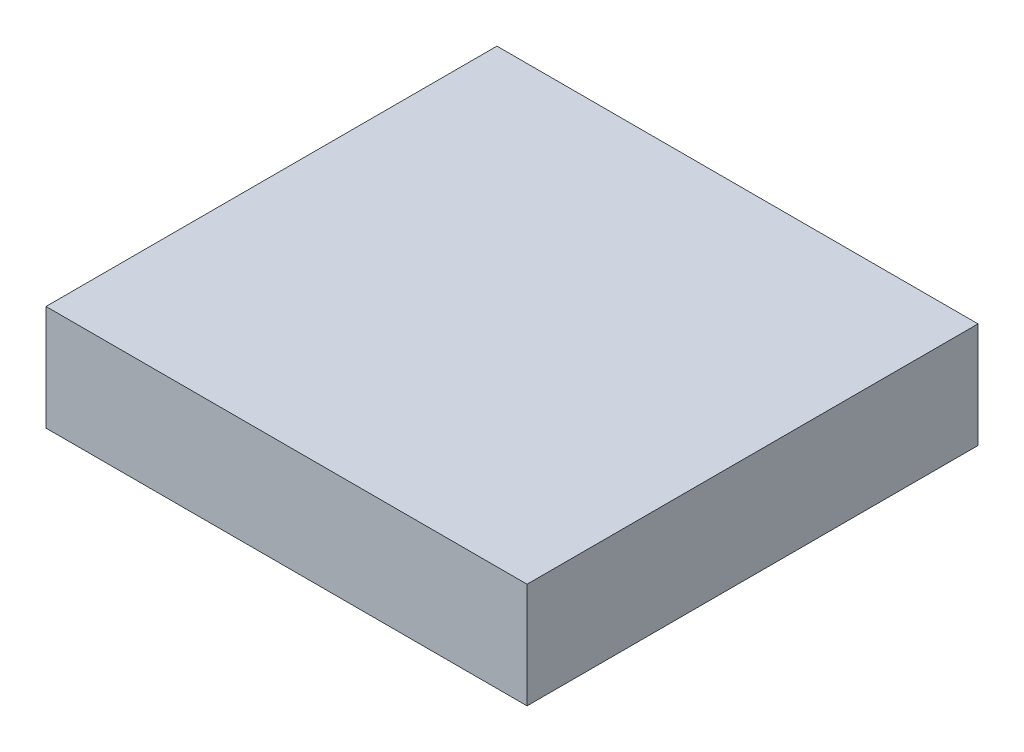
ISO-10303-21;
HEADER;
FILE_DESCRIPTION(('STEP AP214'),'2;1');
FILE_NAME('part.step','',(''),(''),'','','');
FILE_SCHEMA(('AUTOMOTIVE_DESIGN { 1 0 10303 214 1 1 1 1 }'));
ENDSEC;
DATA;
#1=APPLICATION_CONTEXT('core data for automotive mechanical design processes');
#2=APPLICATION_PROTOCOL_DEFINITION('international standard','automotive_design',2000,#1);
#3=PRODUCT_CONTEXT('',#1,'mechanical');
#4=PRODUCT('Part','Part','',(#3));
#5=PRODUCT_RELATED_PRODUCT_CATEGORY('part','',(#4));
#6=PRODUCT_DEFINITION_FORMATION('','',#4);
#7=PRODUCT_DEFINITION_CONTEXT('part definition',#1,'design');
#8=PRODUCT_DEFINITION('design','',#6,#7);
#9=PRODUCT_DEFINITION_SHAPE('','',#8);
#10=(LENGTH_UNIT() NAMED_UNIT(*) SI_UNIT(.MILLI.,.METRE.));
#11=(NAMED_UNIT(*) PLANE_ANGLE_UNIT() SI_UNIT($,.RADIAN.));
#12=(NAMED_UNIT(*) SI_UNIT($,.STERADIAN.) SOLID_ANGLE_UNIT());
#13=UNCERTAINTY_MEASURE_WITH_UNIT(LENGTH_MEASURE(1.E-05),#10,'distance_accuracy_value','');
#14=(GEOMETRIC_REPRESENTATION_CONTEXT(3) GLOBAL_UNCERTAINTY_ASSIGNED_CONTEXT((#13)) GLOBAL_UNIT_ASSIGNED_CONTEXT((#10,
#11,#12)) REPRESENTATION_CONTEXT('',''));
#15=CARTESIAN_POINT('',(0.,0.,0.));
#16=DIRECTION('',(0.,0.,1.));
#17=DIRECTION('',(1.,0.,0.));
#18=AXIS2_PLACEMENT_3D('',#15,#16,#17);
#19=CARTESIAN_POINT('',(0.,4.6736,0.));
#20=DIRECTION('',(1.,0.,0.));
#21=DIRECTION('',(0.,0.,-1.));
#22=AXIS2_PLACEMENT_3D('',#19,#20,#21);
#23=PLANE('',#22);
#24=DIRECTION('',(0.,0.,1.));
#25=VECTOR('',#24,1.);
#26=CARTESIAN_POINT('',(0.,0.,0.));
#27=LINE('',#26,#25);
#28=CARTESIAN_POINT('',(0.,0.,-20.));
#29=VERTEX_POINT('',#28);
#30=CARTESIAN_POINT('',(0.,0.,0.));
#31=VERTEX_POINT('',#30);
#32=EDGE_CURVE('E96',#29,#31,#27,.T.);
#33=ORIENTED_EDGE('',*,*,#32,.T.);
#34=DIRECTION('',(0.,-1.,0.));
#35=VECTOR('',#34,1.);
#36=CARTESIAN_POINT('',(0.,4.6736,0.));
#37=LINE('',#36,#35);
#38=CARTESIAN_POINT('',(0.,4.6736,0.));
#39=VERTEX_POINT('',#38);
#40=EDGE_CURVE('E11',#39,#31,#37,.T.);
#41=ORIENTED_EDGE('',*,*,#40,.F.);
#42=DIRECTION('',(0.,0.,1.));
#43=VECTOR('',#42,1.);
#44=CARTESIAN_POINT('',(0.,4.6736,0.));
#45=LINE('',#44,#43);
#46=CARTESIAN_POINT('',(0.,4.6736,-20.));
#47=VERTEX_POINT('',#46);
#48=EDGE_CURVE('E84',#47,#39,#45,.T.);
#49=ORIENTED_EDGE('',*,*,#48,.F.);
#50=DIRECTION('',(0.,-1.,0.));
#51=VECTOR('',#50,1.);
#52=CARTESIAN_POINT('',(0.,4.6736,-20.));
#53=LINE('',#52,#51);
#54=EDGE_CURVE('E92',#47,#29,#53,.T.);
#55=ORIENTED_EDGE('',*,*,#54,.T.);
#56=EDGE_LOOP('',(#33,#41,#49,#55));
#57=FACE_BOUND('',#56,.T.);
#58=ADVANCED_FACE('F33',(#57),#23,.F.);
#59=CARTESIAN_POINT('',(0.,4.6736,0.));
#60=DIRECTION('',(0.,0.,-1.));
#61=DIRECTION('',(-1.,0.,0.));
#62=AXIS2_PLACEMENT_3D('',#59,#60,#61);
#63=PLANE('',#62);
#64=DIRECTION('',(1.,0.,0.));
#65=VECTOR('',#64,1.);
#66=CARTESIAN_POINT('',(0.,0.,0.));
#67=LINE('',#66,#65);
#68=CARTESIAN_POINT('',(21.336,0.,0.));
#69=VERTEX_POINT('',#68);
#70=EDGE_CURVE('E88',#31,#69,#67,.T.);
#71=ORIENTED_EDGE('',*,*,#70,.T.);
#72=DIRECTION('',(0.,-1.,0.));
#73=VECTOR('',#72,1.);
#74=CARTESIAN_POINT('',(21.336,4.6736,0.));
#75=LINE('',#74,#73);
#76=CARTESIAN_POINT('',(21.336,4.6736,0.));
#77=VERTEX_POINT('',#76);
#78=EDGE_CURVE('E41',#77,#69,#75,.T.);
#79=ORIENTED_EDGE('',*,*,#78,.F.);
#80=DIRECTION('',(1.,0.,0.));
#81=VECTOR('',#80,1.);
#82=CARTESIAN_POINT('',(0.,4.6736,0.));
#83=LINE('',#82,#81);
#84=EDGE_CURVE('E79',#39,#77,#83,.T.);
#85=ORIENTED_EDGE('',*,*,#84,.F.);
#86=ORIENTED_EDGE('',*,*,#40,.T.);
#87=EDGE_LOOP('',(#71,#79,#85,#86));
#88=FACE_BOUND('',#87,.T.);
#89=ADVANCED_FACE('F87',(#88),#63,.F.);
#90=CARTESIAN_POINT('',(21.336,4.6736,0.));
#91=DIRECTION('',(-1.,0.,0.));
#92=DIRECTION('',(0.,0.,1.));
#93=AXIS2_PLACEMENT_3D('',#90,#91,#92);
#94=PLANE('',#93);
#95=DIRECTION('',(0.,0.,-1.));
#96=VECTOR('',#95,1.);
#97=CARTESIAN_POINT('',(21.336,0.,0.));
#98=LINE('',#97,#96);
#99=CARTESIAN_POINT('',(21.336,0.,-20.));
#100=VERTEX_POINT('',#99);
#101=EDGE_CURVE('E66',#69,#100,#98,.T.);
#102=ORIENTED_EDGE('',*,*,#101,.T.);
#103=DIRECTION('',(0.,-1.,0.));
#104=VECTOR('',#103,1.);
#105=CARTESIAN_POINT('',(21.336,4.6736,-20.));
#106=LINE('',#105,#104);
#107=CARTESIAN_POINT('',(21.336,4.6736,-20.));
#108=VERTEX_POINT('',#107);
#109=EDGE_CURVE('E89',#108,#100,#106,.T.);
#110=ORIENTED_EDGE('',*,*,#109,.F.);
#111=DIRECTION('',(0.,0.,-1.));
#112=VECTOR('',#111,1.);
#113=CARTESIAN_POINT('',(21.336,4.6736,0.));
#114=LINE('',#113,#112);
#115=EDGE_CURVE('E82',#77,#108,#114,.T.);
#116=ORIENTED_EDGE('',*,*,#115,.F.);
#117=ORIENTED_EDGE('',*,*,#78,.T.);
#118=EDGE_LOOP('',(#102,#110,#116,#117));
#119=FACE_BOUND('',#118,.T.);
#120=ADVANCED_FACE('F90',(#119),#94,.F.);
#121=CARTESIAN_POINT('',(0.,4.6736,-20.));
#122=DIRECTION('',(0.,0.,1.));
#123=DIRECTION('',(1.,0.,0.));
#124=AXIS2_PLACEMENT_3D('',#121,#122,#123);
#125=PLANE('',#124);
#126=DIRECTION('',(-1.,0.,0.));
#127=VECTOR('',#126,1.);
#128=CARTESIAN_POINT('',(0.,0.,-20.));
#129=LINE('',#128,#127);
#130=EDGE_CURVE('E72',#100,#29,#129,.T.);
#131=ORIENTED_EDGE('',*,*,#130,.T.);
#132=ORIENTED_EDGE('',*,*,#54,.F.);
#133=DIRECTION('',(-1.,0.,0.));
#134=VECTOR('',#133,1.);
#135=CARTESIAN_POINT('',(0.,4.6736,-20.));
#136=LINE('',#135,#134);
#137=EDGE_CURVE('E49',#108,#47,#136,.T.);
#138=ORIENTED_EDGE('',*,*,#137,.F.);
#139=ORIENTED_EDGE('',*,*,#109,.T.);
#140=EDGE_LOOP('',(#131,#132,#138,#139));
#141=FACE_BOUND('',#140,.T.);
#142=ADVANCED_FACE('F103',(#141),#125,.F.);
#143=CARTESIAN_POINT('',(0.,4.6736,0.));
#144=DIRECTION('',(0.,-1.,0.));
#145=DIRECTION('',(0.,0.,-1.));
#146=AXIS2_PLACEMENT_3D('',#143,#144,#145);
#147=PLANE('',#146);
#148=ORIENTED_EDGE('',*,*,#48,.T.);
#149=ORIENTED_EDGE('',*,*,#84,.T.);
#150=ORIENTED_EDGE('',*,*,#115,.T.);
#151=ORIENTED_EDGE('',*,*,#137,.T.);
#152=EDGE_LOOP('',(#148,#149,#150,#151));
#153=FACE_BOUND('',#152,.T.);
#154=ADVANCED_FACE('F80',(#153),#147,.F.);
#155=CARTESIAN_POINT('',(0.,0.,0.));
#156=DIRECTION('',(0.,-1.,0.));
#157=DIRECTION('',(0.,0.,-1.));
#158=AXIS2_PLACEMENT_3D('',#155,#156,#157);
#159=PLANE('',#158);
#160=ORIENTED_EDGE('',*,*,#32,.F.);
#161=ORIENTED_EDGE('',*,*,#130,.F.);
#162=ORIENTED_EDGE('',*,*,#101,.F.);
#163=ORIENTED_EDGE('',*,*,#70,.F.);
#164=EDGE_LOOP('',(#160,#161,#162,#163));
#165=FACE_BOUND('',#164,.T.);
#166=ADVANCED_FACE('F106',(#165),#159,.T.);
#167=CLOSED_SHELL('',(#58,#89,#120,#142,#154,#166));
#168=MANIFOLD_SOLID_BREP('B2',#167);
#169=ADVANCED_BREP_SHAPE_REPRESENTATION('',(#18,#168),#14);
#170=SHAPE_DEFINITION_REPRESENTATION(#9,#169);
ENDSEC;
END-ISO-10303-21;
